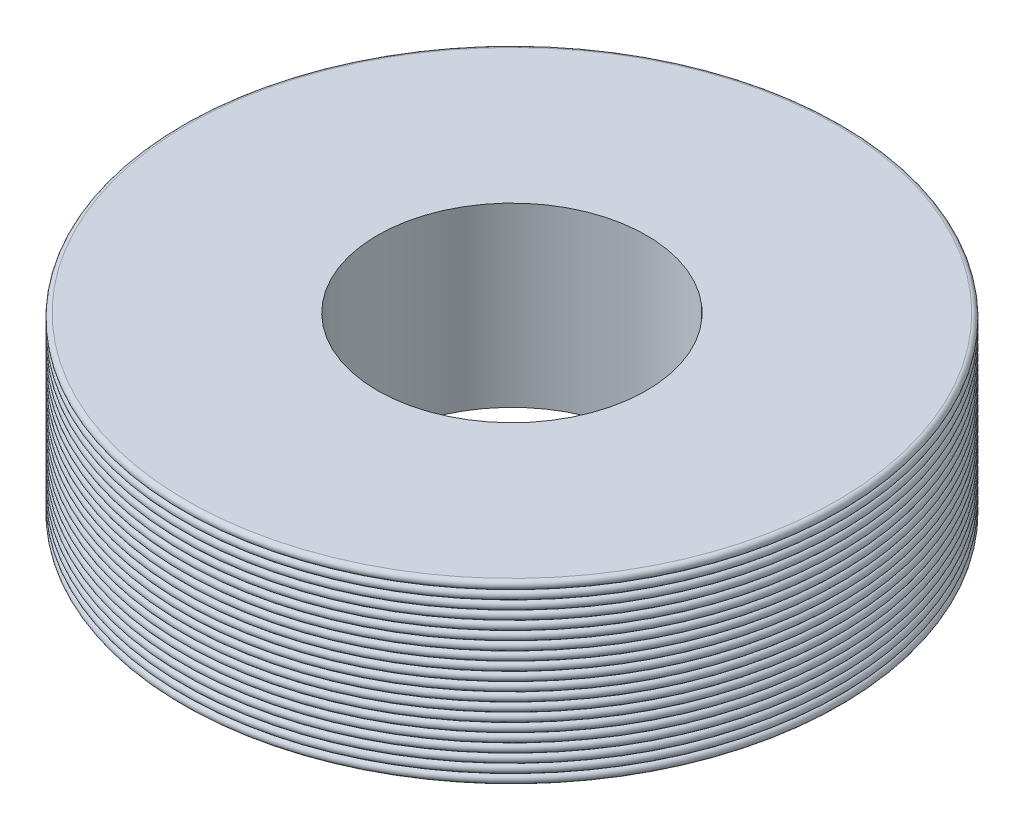
ISO-10303-21;
HEADER;
FILE_DESCRIPTION(('STEP AP214'),'2;1');
FILE_NAME('part.step','',(''),(''),'','','');
FILE_SCHEMA(('AUTOMOTIVE_DESIGN { 1 0 10303 214 1 1 1 1 }'));
ENDSEC;
DATA;
#1=APPLICATION_CONTEXT('core data for automotive mechanical design processes');
#2=APPLICATION_PROTOCOL_DEFINITION('international standard','automotive_design',2000,#1);
#3=PRODUCT_CONTEXT('',#1,'mechanical');
#4=PRODUCT('Part','Part','',(#3));
#5=PRODUCT_RELATED_PRODUCT_CATEGORY('part','',(#4));
#6=PRODUCT_DEFINITION_FORMATION('','',#4);
#7=PRODUCT_DEFINITION_CONTEXT('part definition',#1,'design');
#8=PRODUCT_DEFINITION('design','',#6,#7);
#9=PRODUCT_DEFINITION_SHAPE('','',#8);
#10=(LENGTH_UNIT() NAMED_UNIT(*) SI_UNIT(.MILLI.,.METRE.));
#11=(NAMED_UNIT(*) PLANE_ANGLE_UNIT() SI_UNIT($,.RADIAN.));
#12=(NAMED_UNIT(*) SI_UNIT($,.STERADIAN.) SOLID_ANGLE_UNIT());
#13=UNCERTAINTY_MEASURE_WITH_UNIT(LENGTH_MEASURE(1.E-05),#10,'distance_accuracy_value','');
#14=(GEOMETRIC_REPRESENTATION_CONTEXT(3) GLOBAL_UNCERTAINTY_ASSIGNED_CONTEXT((#13)) GLOBAL_UNIT_ASSIGNED_CONTEXT((#10,
#11,#12)) REPRESENTATION_CONTEXT('',''));
#15=CARTESIAN_POINT('',(0.,0.,0.));
#16=DIRECTION('',(0.,0.,1.));
#17=DIRECTION('',(1.,0.,0.));
#18=AXIS2_PLACEMENT_3D('',#15,#16,#17);
#19=CARTESIAN_POINT('',(0.,46.025,0.));
#20=DIRECTION('',(0.,-1.,0.));
#21=DIRECTION('',(0.,0.,-1.));
#22=AXIS2_PLACEMENT_3D('',#19,#20,#21);
#23=TOROIDAL_SURFACE('',#22,96.6849999999999,1.315);
#24=CARTESIAN_POINT('',(0.,47.34,0.));
#25=DIRECTION('',(0.,-1.,0.));
#26=DIRECTION('',(0.,0.,-1.));
#27=AXIS2_PLACEMENT_3D('',#24,#25,#26);
#28=CIRCLE('',#27,96.6849999999999);
#29=CARTESIAN_POINT('',(0.,47.34,-96.6849999999999));
#30=VERTEX_POINT('',#29);
#31=EDGE_CURVE('E46',#30,#30,#28,.T.);
#32=ORIENTED_EDGE('',*,*,#31,.T.);
#33=EDGE_LOOP('',(#32));
#34=FACE_BOUND('',#33,.T.);
#35=CARTESIAN_POINT('',(0.,44.71,0.));
#36=DIRECTION('',(0.,-1.,0.));
#37=DIRECTION('',(0.,0.,-1.));
#38=AXIS2_PLACEMENT_3D('',#35,#36,#37);
#39=CIRCLE('',#38,96.6849999999999);
#40=CARTESIAN_POINT('',(0.,44.71,-96.6849999999999));
#41=VERTEX_POINT('',#40);
#42=EDGE_CURVE('E107',#41,#41,#39,.T.);
#43=ORIENTED_EDGE('',*,*,#42,.F.);
#44=EDGE_LOOP('',(#43));
#45=FACE_BOUND('',#44,.T.);
#46=ADVANCED_FACE('F35',(#34,#45),#23,.T.);
#47=CARTESIAN_POINT('',(0.,48.655,0.));
#48=DIRECTION('',(0.,-1.,0.));
#49=DIRECTION('',(0.,0.,-1.));
#50=AXIS2_PLACEMENT_3D('',#47,#48,#49);
#51=TOROIDAL_SURFACE('',#50,96.685,1.315);
#52=CARTESIAN_POINT('',(0.,49.97,0.));
#53=DIRECTION('',(0.,-1.,0.));
#54=DIRECTION('',(0.,0.,-1.));
#55=AXIS2_PLACEMENT_3D('',#52,#53,#54);
#56=CIRCLE('',#55,96.685);
#57=CARTESIAN_POINT('',(0.,49.97,-96.685));
#58=VERTEX_POINT('',#57);
#59=EDGE_CURVE('E50',#58,#58,#56,.T.);
#60=ORIENTED_EDGE('',*,*,#59,.T.);
#61=EDGE_LOOP('',(#60));
#62=FACE_BOUND('',#61,.T.);
#63=ORIENTED_EDGE('',*,*,#31,.F.);
#64=EDGE_LOOP('',(#63));
#65=FACE_BOUND('',#64,.T.);
#66=ADVANCED_FACE('F115',(#62,#65),#51,.T.);
#67=CARTESIAN_POINT('',(0.,51.285,0.));
#68=DIRECTION('',(0.,-1.,0.));
#69=DIRECTION('',(0.,0.,-1.));
#70=AXIS2_PLACEMENT_3D('',#67,#68,#69);
#71=TOROIDAL_SURFACE('',#70,96.685,1.315);
#72=CARTESIAN_POINT('',(0.,52.6,0.));
#73=DIRECTION('',(0.,-1.,0.));
#74=DIRECTION('',(0.,0.,-1.));
#75=AXIS2_PLACEMENT_3D('',#72,#73,#74);
#76=CIRCLE('',#75,96.685);
#77=CARTESIAN_POINT('',(0.,52.6,-96.685));
#78=VERTEX_POINT('',#77);
#79=EDGE_CURVE('E53',#78,#78,#76,.T.);
#80=ORIENTED_EDGE('',*,*,#79,.T.);
#81=EDGE_LOOP('',(#80));
#82=FACE_BOUND('',#81,.T.);
#83=ORIENTED_EDGE('',*,*,#59,.F.);
#84=EDGE_LOOP('',(#83));
#85=FACE_BOUND('',#84,.T.);
#86=ADVANCED_FACE('F121',(#82,#85),#71,.T.);
#87=CARTESIAN_POINT('',(0.,1.31500000000001,0.));
#88=DIRECTION('',(0.,-1.,0.));
#89=DIRECTION('',(0.,0.,-1.));
#90=AXIS2_PLACEMENT_3D('',#87,#88,#89);
#91=TOROIDAL_SURFACE('',#90,96.6849999999995,1.315);
#92=CARTESIAN_POINT('',(0.,2.63000000000001,0.));
#93=DIRECTION('',(0.,-1.,0.));
#94=DIRECTION('',(0.,0.,-1.));
#95=AXIS2_PLACEMENT_3D('',#92,#93,#94);
#96=CIRCLE('',#95,96.6849999999995);
#97=CARTESIAN_POINT('',(0.,2.63000000000001,-96.6849999999995));
#98=VERTEX_POINT('',#97);
#99=EDGE_CURVE('E59',#98,#98,#96,.T.);
#100=ORIENTED_EDGE('',*,*,#99,.T.);
#101=EDGE_LOOP('',(#100));
#102=FACE_BOUND('',#101,.T.);
#103=CARTESIAN_POINT('',(0.,0.,0.));
#104=DIRECTION('',(0.,-1.,0.));
#105=DIRECTION('',(0.,0.,-1.));
#106=AXIS2_PLACEMENT_3D('',#103,#104,#105);
#107=CIRCLE('',#106,96.6849999999995);
#108=CARTESIAN_POINT('',(0.,0.,-96.6849999999995));
#109=VERTEX_POINT('',#108);
#110=EDGE_CURVE('E56',#109,#109,#107,.T.);
#111=ORIENTED_EDGE('',*,*,#110,.F.);
#112=EDGE_LOOP('',(#111));
#113=FACE_BOUND('',#112,.T.);
#114=ADVANCED_FACE('F143',(#102,#113),#91,.T.);
#115=CARTESIAN_POINT('',(0.,3.94500000000001,0.));
#116=DIRECTION('',(0.,-1.,0.));
#117=DIRECTION('',(0.,0.,-1.));
#118=AXIS2_PLACEMENT_3D('',#115,#116,#117);
#119=TOROIDAL_SURFACE('',#118,96.6849999999995,1.315);
#120=CARTESIAN_POINT('',(0.,5.26000000000001,0.));
#121=DIRECTION('',(0.,-1.,0.));
#122=DIRECTION('',(0.,0.,-1.));
#123=AXIS2_PLACEMENT_3D('',#120,#121,#122);
#124=CIRCLE('',#123,96.6849999999995);
#125=CARTESIAN_POINT('',(0.,5.26000000000001,-96.6849999999995));
#126=VERTEX_POINT('',#125);
#127=EDGE_CURVE('E62',#126,#126,#124,.T.);
#128=ORIENTED_EDGE('',*,*,#127,.T.);
#129=EDGE_LOOP('',(#128));
#130=FACE_BOUND('',#129,.T.);
#131=ORIENTED_EDGE('',*,*,#99,.F.);
#132=EDGE_LOOP('',(#131));
#133=FACE_BOUND('',#132,.T.);
#134=ADVANCED_FACE('F150',(#130,#133),#119,.T.);
#135=CARTESIAN_POINT('',(0.,6.57500000000001,0.));
#136=DIRECTION('',(0.,-1.,0.));
#137=DIRECTION('',(0.,0.,-1.));
#138=AXIS2_PLACEMENT_3D('',#135,#136,#137);
#139=TOROIDAL_SURFACE('',#138,96.6849999999995,1.315);
#140=CARTESIAN_POINT('',(0.,7.89000000000001,0.));
#141=DIRECTION('',(0.,-1.,0.));
#142=DIRECTION('',(0.,0.,-1.));
#143=AXIS2_PLACEMENT_3D('',#140,#141,#142);
#144=CIRCLE('',#143,96.6849999999995);
#145=CARTESIAN_POINT('',(0.,7.89000000000001,-96.6849999999995));
#146=VERTEX_POINT('',#145);
#147=EDGE_CURVE('E65',#146,#146,#144,.T.);
#148=ORIENTED_EDGE('',*,*,#147,.T.);
#149=EDGE_LOOP('',(#148));
#150=FACE_BOUND('',#149,.T.);
#151=ORIENTED_EDGE('',*,*,#127,.F.);
#152=EDGE_LOOP('',(#151));
#153=FACE_BOUND('',#152,.T.);
#154=ADVANCED_FACE('F156',(#150,#153),#139,.T.);
#155=CARTESIAN_POINT('',(0.,9.20500000000001,0.));
#156=DIRECTION('',(0.,-1.,0.));
#157=DIRECTION('',(0.,0.,-1.));
#158=AXIS2_PLACEMENT_3D('',#155,#156,#157);
#159=TOROIDAL_SURFACE('',#158,96.6849999999995,1.315);
#160=CARTESIAN_POINT('',(0.,10.52,0.));
#161=DIRECTION('',(0.,-1.,0.));
#162=DIRECTION('',(0.,0.,-1.));
#163=AXIS2_PLACEMENT_3D('',#160,#161,#162);
#164=CIRCLE('',#163,96.6849999999996);
#165=CARTESIAN_POINT('',(0.,10.52,-96.6849999999996));
#166=VERTEX_POINT('',#165);
#167=EDGE_CURVE('E68',#166,#166,#164,.T.);
#168=ORIENTED_EDGE('',*,*,#167,.T.);
#169=EDGE_LOOP('',(#168));
#170=FACE_BOUND('',#169,.T.);
#171=ORIENTED_EDGE('',*,*,#147,.F.);
#172=EDGE_LOOP('',(#171));
#173=FACE_BOUND('',#172,.T.);
#174=ADVANCED_FACE('F160',(#170,#173),#159,.T.);
#175=CARTESIAN_POINT('',(0.,11.835,0.));
#176=DIRECTION('',(0.,-1.,0.));
#177=DIRECTION('',(0.,0.,-1.));
#178=AXIS2_PLACEMENT_3D('',#175,#176,#177);
#179=TOROIDAL_SURFACE('',#178,96.6849999999996,1.315);
#180=CARTESIAN_POINT('',(0.,13.15,0.));
#181=DIRECTION('',(0.,-1.,0.));
#182=DIRECTION('',(0.,0.,-1.));
#183=AXIS2_PLACEMENT_3D('',#180,#181,#182);
#184=CIRCLE('',#183,96.6849999999996);
#185=CARTESIAN_POINT('',(0.,13.15,-96.6849999999996));
#186=VERTEX_POINT('',#185);
#187=EDGE_CURVE('E71',#186,#186,#184,.T.);
#188=ORIENTED_EDGE('',*,*,#187,.T.);
#189=EDGE_LOOP('',(#188));
#190=FACE_BOUND('',#189,.T.);
#191=ORIENTED_EDGE('',*,*,#167,.F.);
#192=EDGE_LOOP('',(#191));
#193=FACE_BOUND('',#192,.T.);
#194=ADVANCED_FACE('F164',(#190,#193),#179,.T.);
#195=CARTESIAN_POINT('',(0.,14.465,0.));
#196=DIRECTION('',(0.,-1.,0.));
#197=DIRECTION('',(0.,0.,-1.));
#198=AXIS2_PLACEMENT_3D('',#195,#196,#197);
#199=TOROIDAL_SURFACE('',#198,96.6849999999996,1.315);
#200=CARTESIAN_POINT('',(0.,15.78,0.));
#201=DIRECTION('',(0.,-1.,0.));
#202=DIRECTION('',(0.,0.,-1.));
#203=AXIS2_PLACEMENT_3D('',#200,#201,#202);
#204=CIRCLE('',#203,96.6849999999996);
#205=CARTESIAN_POINT('',(0.,15.78,-96.6849999999996));
#206=VERTEX_POINT('',#205);
#207=EDGE_CURVE('E74',#206,#206,#204,.T.);
#208=ORIENTED_EDGE('',*,*,#207,.T.);
#209=EDGE_LOOP('',(#208));
#210=FACE_BOUND('',#209,.T.);
#211=ORIENTED_EDGE('',*,*,#187,.F.);
#212=EDGE_LOOP('',(#211));
#213=FACE_BOUND('',#212,.T.);
#214=ADVANCED_FACE('F168',(#210,#213),#199,.T.);
#215=CARTESIAN_POINT('',(0.,17.095,0.));
#216=DIRECTION('',(0.,-1.,0.));
#217=DIRECTION('',(0.,0.,-1.));
#218=AXIS2_PLACEMENT_3D('',#215,#216,#217);
#219=TOROIDAL_SURFACE('',#218,96.6849999999996,1.315);
#220=CARTESIAN_POINT('',(0.,18.41,0.));
#221=DIRECTION('',(0.,-1.,0.));
#222=DIRECTION('',(0.,0.,-1.));
#223=AXIS2_PLACEMENT_3D('',#220,#221,#222);
#224=CIRCLE('',#223,96.6849999999996);
#225=CARTESIAN_POINT('',(0.,18.41,-96.6849999999996));
#226=VERTEX_POINT('',#225);
#227=EDGE_CURVE('E77',#226,#226,#224,.T.);
#228=ORIENTED_EDGE('',*,*,#227,.T.);
#229=EDGE_LOOP('',(#228));
#230=FACE_BOUND('',#229,.T.);
#231=ORIENTED_EDGE('',*,*,#207,.F.);
#232=EDGE_LOOP('',(#231));
#233=FACE_BOUND('',#232,.T.);
#234=ADVANCED_FACE('F172',(#230,#233),#219,.T.);
#235=CARTESIAN_POINT('',(0.,19.725,0.));
#236=DIRECTION('',(0.,-1.,0.));
#237=DIRECTION('',(0.,0.,-1.));
#238=AXIS2_PLACEMENT_3D('',#235,#236,#237);
#239=TOROIDAL_SURFACE('',#238,96.6849999999997,1.315);
#240=CARTESIAN_POINT('',(0.,21.04,0.));
#241=DIRECTION('',(0.,-1.,0.));
#242=DIRECTION('',(0.,0.,-1.));
#243=AXIS2_PLACEMENT_3D('',#240,#241,#242);
#244=CIRCLE('',#243,96.6849999999997);
#245=CARTESIAN_POINT('',(0.,21.04,-96.6849999999997));
#246=VERTEX_POINT('',#245);
#247=EDGE_CURVE('E80',#246,#246,#244,.T.);
#248=ORIENTED_EDGE('',*,*,#247,.T.);
#249=EDGE_LOOP('',(#248));
#250=FACE_BOUND('',#249,.T.);
#251=ORIENTED_EDGE('',*,*,#227,.F.);
#252=EDGE_LOOP('',(#251));
#253=FACE_BOUND('',#252,.T.);
#254=ADVANCED_FACE('F176',(#250,#253),#239,.T.);
#255=CARTESIAN_POINT('',(0.,22.355,0.));
#256=DIRECTION('',(0.,-1.,0.));
#257=DIRECTION('',(0.,0.,-1.));
#258=AXIS2_PLACEMENT_3D('',#255,#256,#257);
#259=TOROIDAL_SURFACE('',#258,96.6849999999997,1.315);
#260=CARTESIAN_POINT('',(0.,23.67,0.));
#261=DIRECTION('',(0.,-1.,0.));
#262=DIRECTION('',(0.,0.,-1.));
#263=AXIS2_PLACEMENT_3D('',#260,#261,#262);
#264=CIRCLE('',#263,96.6849999999997);
#265=CARTESIAN_POINT('',(0.,23.67,-96.6849999999997));
#266=VERTEX_POINT('',#265);
#267=EDGE_CURVE('E83',#266,#266,#264,.T.);
#268=ORIENTED_EDGE('',*,*,#267,.T.);
#269=EDGE_LOOP('',(#268));
#270=FACE_BOUND('',#269,.T.);
#271=ORIENTED_EDGE('',*,*,#247,.F.);
#272=EDGE_LOOP('',(#271));
#273=FACE_BOUND('',#272,.T.);
#274=ADVANCED_FACE('F180',(#270,#273),#259,.T.);
#275=CARTESIAN_POINT('',(0.,24.985,0.));
#276=DIRECTION('',(0.,-1.,0.));
#277=DIRECTION('',(0.,0.,-1.));
#278=AXIS2_PLACEMENT_3D('',#275,#276,#277);
#279=TOROIDAL_SURFACE('',#278,96.6849999999997,1.315);
#280=CARTESIAN_POINT('',(0.,26.3,0.));
#281=DIRECTION('',(0.,-1.,0.));
#282=DIRECTION('',(0.,0.,-1.));
#283=AXIS2_PLACEMENT_3D('',#280,#281,#282);
#284=CIRCLE('',#283,96.6849999999997);
#285=CARTESIAN_POINT('',(0.,26.3,-96.6849999999997));
#286=VERTEX_POINT('',#285);
#287=EDGE_CURVE('E86',#286,#286,#284,.T.);
#288=ORIENTED_EDGE('',*,*,#287,.T.);
#289=EDGE_LOOP('',(#288));
#290=FACE_BOUND('',#289,.T.);
#291=ORIENTED_EDGE('',*,*,#267,.F.);
#292=EDGE_LOOP('',(#291));
#293=FACE_BOUND('',#292,.T.);
#294=ADVANCED_FACE('F184',(#290,#293),#279,.T.);
#295=CARTESIAN_POINT('',(0.,27.615,0.));
#296=DIRECTION('',(0.,-1.,0.));
#297=DIRECTION('',(0.,0.,-1.));
#298=AXIS2_PLACEMENT_3D('',#295,#296,#297);
#299=TOROIDAL_SURFACE('',#298,96.6849999999997,1.315);
#300=CARTESIAN_POINT('',(0.,28.93,0.));
#301=DIRECTION('',(0.,-1.,0.));
#302=DIRECTION('',(0.,0.,-1.));
#303=AXIS2_PLACEMENT_3D('',#300,#301,#302);
#304=CIRCLE('',#303,96.6849999999998);
#305=CARTESIAN_POINT('',(0.,28.93,-96.6849999999998));
#306=VERTEX_POINT('',#305);
#307=EDGE_CURVE('E89',#306,#306,#304,.T.);
#308=ORIENTED_EDGE('',*,*,#307,.T.);
#309=EDGE_LOOP('',(#308));
#310=FACE_BOUND('',#309,.T.);
#311=ORIENTED_EDGE('',*,*,#287,.F.);
#312=EDGE_LOOP('',(#311));
#313=FACE_BOUND('',#312,.T.);
#314=ADVANCED_FACE('F188',(#310,#313),#299,.T.);
#315=CARTESIAN_POINT('',(0.,30.245,0.));
#316=DIRECTION('',(0.,-1.,0.));
#317=DIRECTION('',(0.,0.,-1.));
#318=AXIS2_PLACEMENT_3D('',#315,#316,#317);
#319=TOROIDAL_SURFACE('',#318,96.6849999999998,1.315);
#320=CARTESIAN_POINT('',(0.,31.56,0.));
#321=DIRECTION('',(0.,-1.,0.));
#322=DIRECTION('',(0.,0.,-1.));
#323=AXIS2_PLACEMENT_3D('',#320,#321,#322);
#324=CIRCLE('',#323,96.6849999999998);
#325=CARTESIAN_POINT('',(0.,31.56,-96.6849999999998));
#326=VERTEX_POINT('',#325);
#327=EDGE_CURVE('E92',#326,#326,#324,.T.);
#328=ORIENTED_EDGE('',*,*,#327,.T.);
#329=EDGE_LOOP('',(#328));
#330=FACE_BOUND('',#329,.T.);
#331=ORIENTED_EDGE('',*,*,#307,.F.);
#332=EDGE_LOOP('',(#331));
#333=FACE_BOUND('',#332,.T.);
#334=ADVANCED_FACE('F192',(#330,#333),#319,.T.);
#335=CARTESIAN_POINT('',(0.,32.875,0.));
#336=DIRECTION('',(0.,-1.,0.));
#337=DIRECTION('',(0.,0.,-1.));
#338=AXIS2_PLACEMENT_3D('',#335,#336,#337);
#339=TOROIDAL_SURFACE('',#338,96.6849999999998,1.315);
#340=CARTESIAN_POINT('',(0.,34.19,0.));
#341=DIRECTION('',(0.,-1.,0.));
#342=DIRECTION('',(0.,0.,-1.));
#343=AXIS2_PLACEMENT_3D('',#340,#341,#342);
#344=CIRCLE('',#343,96.6849999999998);
#345=CARTESIAN_POINT('',(0.,34.19,-96.6849999999998));
#346=VERTEX_POINT('',#345);
#347=EDGE_CURVE('E95',#346,#346,#344,.T.);
#348=ORIENTED_EDGE('',*,*,#347,.T.);
#349=EDGE_LOOP('',(#348));
#350=FACE_BOUND('',#349,.T.);
#351=ORIENTED_EDGE('',*,*,#327,.F.);
#352=EDGE_LOOP('',(#351));
#353=FACE_BOUND('',#352,.T.);
#354=ADVANCED_FACE('F196',(#350,#353),#339,.T.);
#355=CARTESIAN_POINT('',(0.,35.505,0.));
#356=DIRECTION('',(0.,-1.,0.));
#357=DIRECTION('',(0.,0.,-1.));
#358=AXIS2_PLACEMENT_3D('',#355,#356,#357);
#359=TOROIDAL_SURFACE('',#358,96.6849999999998,1.315);
#360=CARTESIAN_POINT('',(0.,36.82,0.));
#361=DIRECTION('',(0.,-1.,0.));
#362=DIRECTION('',(0.,0.,-1.));
#363=AXIS2_PLACEMENT_3D('',#360,#361,#362);
#364=CIRCLE('',#363,96.6849999999998);
#365=CARTESIAN_POINT('',(0.,36.82,-96.6849999999998));
#366=VERTEX_POINT('',#365);
#367=EDGE_CURVE('E98',#366,#366,#364,.T.);
#368=ORIENTED_EDGE('',*,*,#367,.T.);
#369=EDGE_LOOP('',(#368));
#370=FACE_BOUND('',#369,.T.);
#371=ORIENTED_EDGE('',*,*,#347,.F.);
#372=EDGE_LOOP('',(#371));
#373=FACE_BOUND('',#372,.T.);
#374=ADVANCED_FACE('F200',(#370,#373),#359,.T.);
#375=CARTESIAN_POINT('',(0.,38.135,0.));
#376=DIRECTION('',(0.,-1.,0.));
#377=DIRECTION('',(0.,0.,-1.));
#378=AXIS2_PLACEMENT_3D('',#375,#376,#377);
#379=TOROIDAL_SURFACE('',#378,96.6849999999999,1.315);
#380=CARTESIAN_POINT('',(0.,39.45,0.));
#381=DIRECTION('',(0.,-1.,0.));
#382=DIRECTION('',(0.,0.,-1.));
#383=AXIS2_PLACEMENT_3D('',#380,#381,#382);
#384=CIRCLE('',#383,96.6849999999999);
#385=CARTESIAN_POINT('',(0.,39.45,-96.6849999999999));
#386=VERTEX_POINT('',#385);
#387=EDGE_CURVE('E101',#386,#386,#384,.T.);
#388=ORIENTED_EDGE('',*,*,#387,.T.);
#389=EDGE_LOOP('',(#388));
#390=FACE_BOUND('',#389,.T.);
#391=ORIENTED_EDGE('',*,*,#367,.F.);
#392=EDGE_LOOP('',(#391));
#393=FACE_BOUND('',#392,.T.);
#394=ADVANCED_FACE('F204',(#390,#393),#379,.T.);
#395=CARTESIAN_POINT('',(0.,40.765,0.));
#396=DIRECTION('',(0.,-1.,0.));
#397=DIRECTION('',(0.,0.,-1.));
#398=AXIS2_PLACEMENT_3D('',#395,#396,#397);
#399=TOROIDAL_SURFACE('',#398,96.6849999999999,1.315);
#400=CARTESIAN_POINT('',(0.,42.08,0.));
#401=DIRECTION('',(0.,-1.,0.));
#402=DIRECTION('',(0.,0.,-1.));
#403=AXIS2_PLACEMENT_3D('',#400,#401,#402);
#404=CIRCLE('',#403,96.6849999999999);
#405=CARTESIAN_POINT('',(0.,42.08,-96.6849999999999));
#406=VERTEX_POINT('',#405);
#407=EDGE_CURVE('E104',#406,#406,#404,.T.);
#408=ORIENTED_EDGE('',*,*,#407,.T.);
#409=EDGE_LOOP('',(#408));
#410=FACE_BOUND('',#409,.T.);
#411=ORIENTED_EDGE('',*,*,#387,.F.);
#412=EDGE_LOOP('',(#411));
#413=FACE_BOUND('',#412,.T.);
#414=ADVANCED_FACE('F136',(#410,#413),#399,.T.);
#415=CARTESIAN_POINT('',(0.,43.395,0.));
#416=DIRECTION('',(0.,-1.,0.));
#417=DIRECTION('',(0.,0.,-1.));
#418=AXIS2_PLACEMENT_3D('',#415,#416,#417);
#419=TOROIDAL_SURFACE('',#418,96.6849999999999,1.315);
#420=ORIENTED_EDGE('',*,*,#42,.T.);
#421=EDGE_LOOP('',(#420));
#422=FACE_BOUND('',#421,.T.);
#423=ORIENTED_EDGE('',*,*,#407,.F.);
#424=EDGE_LOOP('',(#423));
#425=FACE_BOUND('',#424,.T.);
#426=ADVANCED_FACE('F111',(#422,#425),#419,.T.);
#427=CARTESIAN_POINT('',(0.,52.6,0.));
#428=DIRECTION('',(0.,1.,0.));
#429=DIRECTION('',(0.,0.,1.));
#430=AXIS2_PLACEMENT_3D('',#427,#428,#429);
#431=PLANE('',#430);
#432=ORIENTED_EDGE('',*,*,#79,.F.);
#433=EDGE_LOOP('',(#432));
#434=FACE_BOUND('',#433,.T.);
#435=CARTESIAN_POINT('',(0.,52.6,0.));
#436=DIRECTION('',(0.,1.,0.));
#437=DIRECTION('',(0.,0.,1.));
#438=AXIS2_PLACEMENT_3D('',#435,#436,#437);
#439=CIRCLE('',#438,40.);
#440=CARTESIAN_POINT('',(0.,52.6,40.));
#441=VERTEX_POINT('',#440);
#442=EDGE_CURVE('E10',#441,#441,#439,.T.);
#443=ORIENTED_EDGE('',*,*,#442,.F.);
#444=EDGE_LOOP('',(#443));
#445=FACE_BOUND('',#444,.T.);
#446=ADVANCED_FACE('F128',(#434,#445),#431,.T.);
#447=CARTESIAN_POINT('',(0.,0.,0.));
#448=DIRECTION('',(0.,1.,0.));
#449=DIRECTION('',(0.,0.,1.));
#450=AXIS2_PLACEMENT_3D('',#447,#448,#449);
#451=PLANE('',#450);
#452=ORIENTED_EDGE('',*,*,#110,.T.);
#453=EDGE_LOOP('',(#452));
#454=FACE_BOUND('',#453,.T.);
#455=CARTESIAN_POINT('',(0.,0.,0.));
#456=DIRECTION('',(0.,1.,0.));
#457=DIRECTION('',(0.,0.,1.));
#458=AXIS2_PLACEMENT_3D('',#455,#456,#457);
#459=CIRCLE('',#458,40.);
#460=CARTESIAN_POINT('',(0.,0.,40.));
#461=VERTEX_POINT('',#460);
#462=EDGE_CURVE('E39',#461,#461,#459,.T.);
#463=ORIENTED_EDGE('',*,*,#462,.T.);
#464=EDGE_LOOP('',(#463));
#465=FACE_BOUND('',#464,.T.);
#466=ADVANCED_FACE('F37',(#454,#465),#451,.F.);
#467=CARTESIAN_POINT('',(0.,52.6,0.));
#468=DIRECTION('',(0.,-1.,0.));
#469=DIRECTION('',(0.,0.,-1.));
#470=AXIS2_PLACEMENT_3D('',#467,#468,#469);
#471=CYLINDRICAL_SURFACE('',#470,40.);
#472=ORIENTED_EDGE('',*,*,#442,.T.);
#473=EDGE_LOOP('',(#472));
#474=FACE_BOUND('',#473,.T.);
#475=ORIENTED_EDGE('',*,*,#462,.F.);
#476=EDGE_LOOP('',(#475));
#477=FACE_BOUND('',#476,.T.);
#478=ADVANCED_FACE('F126',(#474,#477),#471,.F.);
#479=CLOSED_SHELL('',(#46,#66,#86,#114,#134,#154,#174,#194,#214,#234,#254,#274,#294,#314,#334,
#354,#374,#394,#414,#426,#446,#466,#478));
#480=MANIFOLD_SOLID_BREP('B2',#479);
#481=ADVANCED_BREP_SHAPE_REPRESENTATION('',(#18,#480),#14);
#482=SHAPE_DEFINITION_REPRESENTATION(#9,#481);
ENDSEC;
END-ISO-10303-21;
